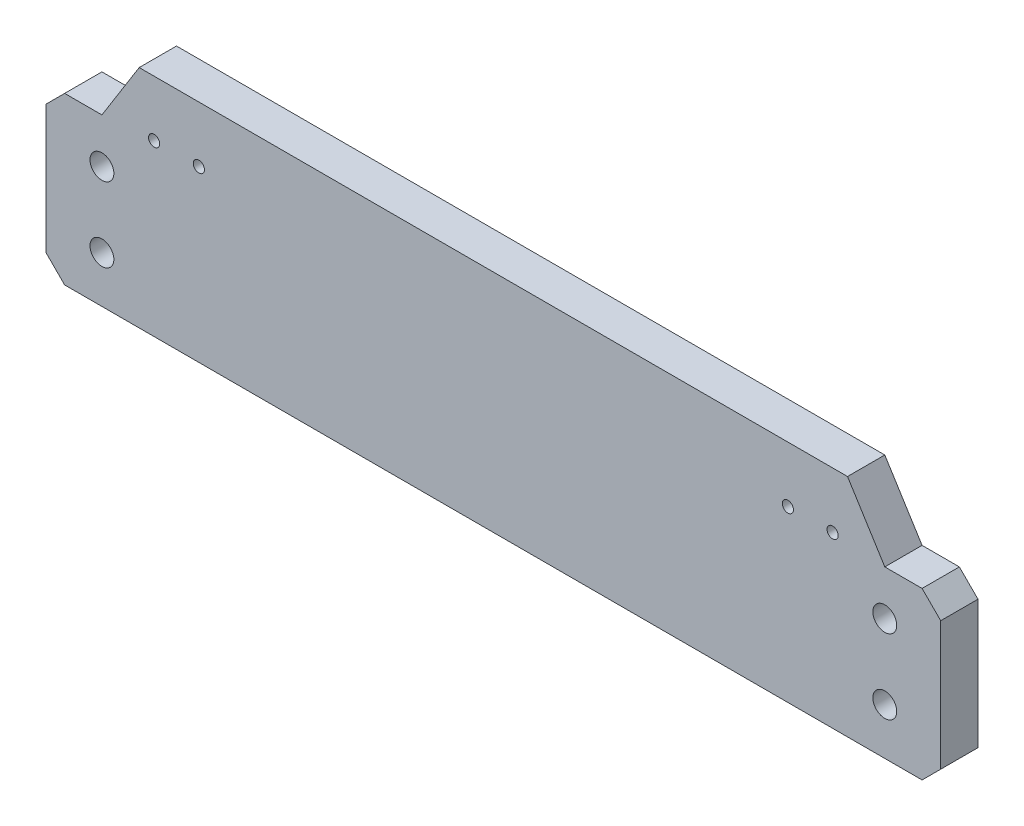
ISO-10303-21;
HEADER;
FILE_DESCRIPTION(('STEP AP214'),'2;1');
FILE_NAME('part.step','',(''),(''),'','','');
FILE_SCHEMA(('AUTOMOTIVE_DESIGN { 1 0 10303 214 1 1 1 1 }'));
ENDSEC;
DATA;
#1=APPLICATION_CONTEXT('core data for automotive mechanical design processes');
#2=APPLICATION_PROTOCOL_DEFINITION('international standard','automotive_design',2000,#1);
#3=PRODUCT_CONTEXT('',#1,'mechanical');
#4=PRODUCT('Part','Part','',(#3));
#5=PRODUCT_RELATED_PRODUCT_CATEGORY('part','',(#4));
#6=PRODUCT_DEFINITION_FORMATION('','',#4);
#7=PRODUCT_DEFINITION_CONTEXT('part definition',#1,'design');
#8=PRODUCT_DEFINITION('design','',#6,#7);
#9=PRODUCT_DEFINITION_SHAPE('','',#8);
#10=(LENGTH_UNIT() NAMED_UNIT(*) SI_UNIT(.MILLI.,.METRE.));
#11=(NAMED_UNIT(*) PLANE_ANGLE_UNIT() SI_UNIT($,.RADIAN.));
#12=(NAMED_UNIT(*) SI_UNIT($,.STERADIAN.) SOLID_ANGLE_UNIT());
#13=UNCERTAINTY_MEASURE_WITH_UNIT(LENGTH_MEASURE(1.E-05),#10,'distance_accuracy_value','');
#14=(GEOMETRIC_REPRESENTATION_CONTEXT(3) GLOBAL_UNCERTAINTY_ASSIGNED_CONTEXT((#13)) GLOBAL_UNIT_ASSIGNED_CONTEXT((#10,
#11,#12)) REPRESENTATION_CONTEXT('',''));
#15=CARTESIAN_POINT('',(0.,0.,0.));
#16=DIRECTION('',(0.,0.,1.));
#17=DIRECTION('',(1.,0.,0.));
#18=AXIS2_PLACEMENT_3D('',#15,#16,#17);
#19=CARTESIAN_POINT('',(0.,0.,10.));
#20=DIRECTION('',(0.,0.,-1.));
#21=DIRECTION('',(-1.,0.,0.));
#22=AXIS2_PLACEMENT_3D('',#19,#20,#21);
#23=PLANE('',#22);
#24=DIRECTION('',(1.,0.,0.));
#25=VECTOR('',#24,1.);
#26=CARTESIAN_POINT('',(-120.,-30.25,10.));
#27=LINE('',#26,#25);
#28=CARTESIAN_POINT('',(-115.,-30.25,10.));
#29=VERTEX_POINT('',#28);
#30=CARTESIAN_POINT('',(115.,-30.25,10.));
#31=VERTEX_POINT('',#30);
#32=EDGE_CURVE('E238',#29,#31,#27,.T.);
#33=ORIENTED_EDGE('',*,*,#32,.T.);
#34=DIRECTION('',(-0.707106781186549,-0.707106781186546,0.));
#35=VECTOR('',#34,1.);
#36=CARTESIAN_POINT('',(120.,-25.25,10.));
#37=LINE('',#36,#35);
#38=CARTESIAN_POINT('',(120.,-25.25,10.));
#39=VERTEX_POINT('',#38);
#40=EDGE_CURVE('E272',#31,#39,#37,.F.);
#41=ORIENTED_EDGE('',*,*,#40,.T.);
#42=DIRECTION('',(0.,1.,0.));
#43=VECTOR('',#42,1.);
#44=CARTESIAN_POINT('',(120.,-30.25,10.));
#45=LINE('',#44,#43);
#46=CARTESIAN_POINT('',(120.,9.24999999999996,10.));
#47=VERTEX_POINT('',#46);
#48=EDGE_CURVE('E230',#39,#47,#45,.T.);
#49=ORIENTED_EDGE('',*,*,#48,.T.);
#50=DIRECTION('',(0.70710678118655,-0.707106781186545,0.));
#51=VECTOR('',#50,1.);
#52=CARTESIAN_POINT('',(120.,9.24999999999996,10.));
#53=LINE('',#52,#51);
#54=CARTESIAN_POINT('',(115.,14.2499999999999,10.));
#55=VERTEX_POINT('',#54);
#56=EDGE_CURVE('E57',#47,#55,#53,.F.);
#57=ORIENTED_EDGE('',*,*,#56,.T.);
#58=DIRECTION('',(1.,0.,0.));
#59=VECTOR('',#58,1.);
#60=CARTESIAN_POINT('',(120.,14.2499999999999,10.));
#61=LINE('',#60,#59);
#62=CARTESIAN_POINT('',(105.,14.2499999999999,10.));
#63=VERTEX_POINT('',#62);
#64=EDGE_CURVE('E173',#63,#55,#61,.T.);
#65=ORIENTED_EDGE('',*,*,#64,.F.);
#66=DIRECTION('',(0.52999894000318,-0.847998304005088,0.));
#67=VECTOR('',#66,1.);
#68=CARTESIAN_POINT('',(105.,14.2499999999999,10.));
#69=LINE('',#68,#67);
#70=CARTESIAN_POINT('',(95.,30.2499999999999,10.));
#71=VERTEX_POINT('',#70);
#72=EDGE_CURVE('E164',#71,#63,#69,.T.);
#73=ORIENTED_EDGE('',*,*,#72,.F.);
#74=DIRECTION('',(-1.,0.,0.));
#75=VECTOR('',#74,1.);
#76=CARTESIAN_POINT('',(-120.,30.25,10.));
#77=LINE('',#76,#75);
#78=CARTESIAN_POINT('',(-95.,30.25,10.));
#79=VERTEX_POINT('',#78);
#80=EDGE_CURVE('E232',#71,#79,#77,.T.);
#81=ORIENTED_EDGE('',*,*,#80,.T.);
#82=DIRECTION('',(0.52999894000318,0.847998304005088,0.));
#83=VECTOR('',#82,1.);
#84=CARTESIAN_POINT('',(-105.,14.25,10.));
#85=LINE('',#84,#83);
#86=CARTESIAN_POINT('',(-105.,14.25,10.));
#87=VERTEX_POINT('',#86);
#88=EDGE_CURVE('E148',#87,#79,#85,.T.);
#89=ORIENTED_EDGE('',*,*,#88,.F.);
#90=DIRECTION('',(1.,0.,0.));
#91=VECTOR('',#90,1.);
#92=CARTESIAN_POINT('',(-120.,14.25,10.));
#93=LINE('',#92,#91);
#94=CARTESIAN_POINT('',(-115.,14.25,10.));
#95=VERTEX_POINT('',#94);
#96=EDGE_CURVE('E154',#95,#87,#93,.T.);
#97=ORIENTED_EDGE('',*,*,#96,.F.);
#98=DIRECTION('',(0.707106781186546,0.707106781186549,0.));
#99=VECTOR('',#98,1.);
#100=CARTESIAN_POINT('',(-115.,14.25,10.));
#101=LINE('',#100,#99);
#102=CARTESIAN_POINT('',(-120.,9.24999999999996,10.));
#103=VERTEX_POINT('',#102);
#104=EDGE_CURVE('E268',#95,#103,#101,.F.);
#105=ORIENTED_EDGE('',*,*,#104,.T.);
#106=DIRECTION('',(0.,-1.,0.));
#107=VECTOR('',#106,1.);
#108=CARTESIAN_POINT('',(-120.,-30.25,10.));
#109=LINE('',#108,#107);
#110=CARTESIAN_POINT('',(-120.,-25.25,10.));
#111=VERTEX_POINT('',#110);
#112=EDGE_CURVE('E236',#103,#111,#109,.T.);
#113=ORIENTED_EDGE('',*,*,#112,.T.);
#114=DIRECTION('',(-0.707106781186546,0.707106781186549,0.));
#115=VECTOR('',#114,1.);
#116=CARTESIAN_POINT('',(-115.,-30.25,10.));
#117=LINE('',#116,#115);
#118=EDGE_CURVE('E270',#111,#29,#117,.F.);
#119=ORIENTED_EDGE('',*,*,#118,.T.);
#120=EDGE_LOOP('',(#33,#41,#49,#57,#65,#73,#81,#89,#97,#105,#113,#119));
#121=FACE_BOUND('',#120,.T.);
#122=CARTESIAN_POINT('',(-105.,2.24999999999997,10.));
#123=DIRECTION('',(0.,0.,1.));
#124=DIRECTION('',(1.,0.,0.));
#125=AXIS2_PLACEMENT_3D('',#122,#123,#124);
#126=CIRCLE('',#125,3.2);
#127=CARTESIAN_POINT('',(-101.8,2.24999999999997,10.));
#128=VERTEX_POINT('',#127);
#129=EDGE_CURVE('E224',#128,#128,#126,.T.);
#130=ORIENTED_EDGE('',*,*,#129,.F.);
#131=EDGE_LOOP('',(#130));
#132=FACE_BOUND('',#131,.T.);
#133=CARTESIAN_POINT('',(-105.,-17.75,10.));
#134=DIRECTION('',(0.,0.,1.));
#135=DIRECTION('',(1.,0.,0.));
#136=AXIS2_PLACEMENT_3D('',#133,#134,#135);
#137=CIRCLE('',#136,3.2);
#138=CARTESIAN_POINT('',(-101.8,-17.75,10.));
#139=VERTEX_POINT('',#138);
#140=EDGE_CURVE('E218',#139,#139,#137,.T.);
#141=ORIENTED_EDGE('',*,*,#140,.F.);
#142=EDGE_LOOP('',(#141));
#143=FACE_BOUND('',#142,.T.);
#144=CARTESIAN_POINT('',(105.,-17.75,10.));
#145=DIRECTION('',(0.,0.,1.));
#146=DIRECTION('',(-1.,0.,0.));
#147=AXIS2_PLACEMENT_3D('',#144,#145,#146);
#148=CIRCLE('',#147,3.2);
#149=CARTESIAN_POINT('',(101.8,-17.75,10.));
#150=VERTEX_POINT('',#149);
#151=EDGE_CURVE('E212',#150,#150,#148,.T.);
#152=ORIENTED_EDGE('',*,*,#151,.F.);
#153=EDGE_LOOP('',(#152));
#154=FACE_BOUND('',#153,.T.);
#155=CARTESIAN_POINT('',(105.,2.25,10.));
#156=DIRECTION('',(0.,0.,1.));
#157=DIRECTION('',(-1.,0.,0.));
#158=AXIS2_PLACEMENT_3D('',#155,#156,#157);
#159=CIRCLE('',#158,3.2);
#160=CARTESIAN_POINT('',(101.8,2.25,10.));
#161=VERTEX_POINT('',#160);
#162=EDGE_CURVE('E206',#161,#161,#159,.T.);
#163=ORIENTED_EDGE('',*,*,#162,.F.);
#164=EDGE_LOOP('',(#163));
#165=FACE_BOUND('',#164,.T.);
#166=CARTESIAN_POINT('',(-91.,15.25,10.));
#167=DIRECTION('',(0.,0.,1.));
#168=DIRECTION('',(1.,0.,0.));
#169=AXIS2_PLACEMENT_3D('',#166,#167,#168);
#170=CIRCLE('',#169,1.5);
#171=CARTESIAN_POINT('',(-89.5,15.25,10.));
#172=VERTEX_POINT('',#171);
#173=EDGE_CURVE('E200',#172,#172,#170,.T.);
#174=ORIENTED_EDGE('',*,*,#173,.F.);
#175=EDGE_LOOP('',(#174));
#176=FACE_BOUND('',#175,.T.);
#177=CARTESIAN_POINT('',(-79.,15.25,10.));
#178=DIRECTION('',(0.,0.,1.));
#179=DIRECTION('',(1.,0.,0.));
#180=AXIS2_PLACEMENT_3D('',#177,#178,#179);
#181=CIRCLE('',#180,1.5);
#182=CARTESIAN_POINT('',(-77.5,15.25,10.));
#183=VERTEX_POINT('',#182);
#184=EDGE_CURVE('E194',#183,#183,#181,.T.);
#185=ORIENTED_EDGE('',*,*,#184,.F.);
#186=EDGE_LOOP('',(#185));
#187=FACE_BOUND('',#186,.T.);
#188=CARTESIAN_POINT('',(79.,15.25,10.));
#189=DIRECTION('',(0.,0.,1.));
#190=DIRECTION('',(-1.,0.,0.));
#191=AXIS2_PLACEMENT_3D('',#188,#189,#190);
#192=CIRCLE('',#191,1.5);
#193=CARTESIAN_POINT('',(77.5,15.25,10.));
#194=VERTEX_POINT('',#193);
#195=EDGE_CURVE('E188',#194,#194,#192,.T.);
#196=ORIENTED_EDGE('',*,*,#195,.F.);
#197=EDGE_LOOP('',(#196));
#198=FACE_BOUND('',#197,.T.);
#199=CARTESIAN_POINT('',(91.,15.25,10.));
#200=DIRECTION('',(0.,0.,1.));
#201=DIRECTION('',(-1.,0.,0.));
#202=AXIS2_PLACEMENT_3D('',#199,#200,#201);
#203=CIRCLE('',#202,1.5);
#204=CARTESIAN_POINT('',(89.5,15.25,10.));
#205=VERTEX_POINT('',#204);
#206=EDGE_CURVE('E182',#205,#205,#203,.T.);
#207=ORIENTED_EDGE('',*,*,#206,.F.);
#208=EDGE_LOOP('',(#207));
#209=FACE_BOUND('',#208,.T.);
#210=ADVANCED_FACE('F41',(#121,#132,#143,#154,#165,#176,#187,#198,#209),#23,.F.);
#211=CARTESIAN_POINT('',(0.,0.,0.));
#212=DIRECTION('',(0.,0.,-1.));
#213=DIRECTION('',(-1.,0.,0.));
#214=AXIS2_PLACEMENT_3D('',#211,#212,#213);
#215=PLANE('',#214);
#216=DIRECTION('',(0.,1.,0.));
#217=VECTOR('',#216,1.);
#218=CARTESIAN_POINT('',(120.,-30.25,0.));
#219=LINE('',#218,#217);
#220=CARTESIAN_POINT('',(120.,-25.25,0.));
#221=VERTEX_POINT('',#220);
#222=CARTESIAN_POINT('',(120.,9.24999999999996,0.));
#223=VERTEX_POINT('',#222);
#224=EDGE_CURVE('E227',#221,#223,#219,.T.);
#225=ORIENTED_EDGE('',*,*,#224,.F.);
#226=DIRECTION('',(0.707106781186549,0.707106781186546,0.));
#227=VECTOR('',#226,1.);
#228=CARTESIAN_POINT('',(72.6249999999997,-72.6250000000001,0.));
#229=LINE('',#228,#227);
#230=CARTESIAN_POINT('',(115.,-30.25,0.));
#231=VERTEX_POINT('',#230);
#232=EDGE_CURVE('E260',#221,#231,#229,.F.);
#233=ORIENTED_EDGE('',*,*,#232,.T.);
#234=DIRECTION('',(1.,0.,0.));
#235=VECTOR('',#234,1.);
#236=CARTESIAN_POINT('',(-120.,-30.25,0.));
#237=LINE('',#236,#235);
#238=CARTESIAN_POINT('',(-115.,-30.25,0.));
#239=VERTEX_POINT('',#238);
#240=EDGE_CURVE('E233',#239,#231,#237,.T.);
#241=ORIENTED_EDGE('',*,*,#240,.F.);
#242=DIRECTION('',(0.707106781186546,-0.707106781186549,0.));
#243=VECTOR('',#242,1.);
#244=CARTESIAN_POINT('',(-72.6250000000003,-72.6249999999999,0.));
#245=LINE('',#244,#243);
#246=CARTESIAN_POINT('',(-120.,-25.25,0.));
#247=VERTEX_POINT('',#246);
#248=EDGE_CURVE('E258',#239,#247,#245,.F.);
#249=ORIENTED_EDGE('',*,*,#248,.T.);
#250=DIRECTION('',(0.,-1.,0.));
#251=VECTOR('',#250,1.);
#252=CARTESIAN_POINT('',(-120.,-30.25,0.));
#253=LINE('',#252,#251);
#254=CARTESIAN_POINT('',(-120.,9.24999999999996,0.));
#255=VERTEX_POINT('',#254);
#256=EDGE_CURVE('E246',#255,#247,#253,.T.);
#257=ORIENTED_EDGE('',*,*,#256,.F.);
#258=DIRECTION('',(-0.707106781186546,-0.707106781186549,0.));
#259=VECTOR('',#258,1.);
#260=CARTESIAN_POINT('',(-64.6250000000003,64.6249999999999,0.));
#261=LINE('',#260,#259);
#262=CARTESIAN_POINT('',(-115.,14.25,0.));
#263=VERTEX_POINT('',#262);
#264=EDGE_CURVE('E144',#255,#263,#261,.F.);
#265=ORIENTED_EDGE('',*,*,#264,.T.);
#266=DIRECTION('',(1.,0.,0.));
#267=VECTOR('',#266,1.);
#268=CARTESIAN_POINT('',(-120.,14.25,0.));
#269=LINE('',#268,#267);
#270=CARTESIAN_POINT('',(-105.,14.25,0.));
#271=VERTEX_POINT('',#270);
#272=EDGE_CURVE('E133',#263,#271,#269,.T.);
#273=ORIENTED_EDGE('',*,*,#272,.T.);
#274=DIRECTION('',(0.52999894000318,0.847998304005088,0.));
#275=VECTOR('',#274,1.);
#276=CARTESIAN_POINT('',(-105.,14.25,0.));
#277=LINE('',#276,#275);
#278=CARTESIAN_POINT('',(-95.,30.25,0.));
#279=VERTEX_POINT('',#278);
#280=EDGE_CURVE('E140',#271,#279,#277,.T.);
#281=ORIENTED_EDGE('',*,*,#280,.T.);
#282=DIRECTION('',(-1.,0.,0.));
#283=VECTOR('',#282,1.);
#284=CARTESIAN_POINT('',(-120.,30.25,0.));
#285=LINE('',#284,#283);
#286=CARTESIAN_POINT('',(95.,30.25,0.));
#287=VERTEX_POINT('',#286);
#288=EDGE_CURVE('E244',#287,#279,#285,.T.);
#289=ORIENTED_EDGE('',*,*,#288,.F.);
#290=DIRECTION('',(0.52999894000318,-0.847998304005088,0.));
#291=VECTOR('',#290,1.);
#292=CARTESIAN_POINT('',(105.,14.2499999999999,0.));
#293=LINE('',#292,#291);
#294=CARTESIAN_POINT('',(105.,14.2499999999999,0.));
#295=VERTEX_POINT('',#294);
#296=EDGE_CURVE('E175',#287,#295,#293,.T.);
#297=ORIENTED_EDGE('',*,*,#296,.T.);
#298=DIRECTION('',(1.,0.,0.));
#299=VECTOR('',#298,1.);
#300=CARTESIAN_POINT('',(120.,14.2499999999999,0.));
#301=LINE('',#300,#299);
#302=CARTESIAN_POINT('',(115.,14.2499999999999,0.));
#303=VERTEX_POINT('',#302);
#304=EDGE_CURVE('E170',#295,#303,#301,.T.);
#305=ORIENTED_EDGE('',*,*,#304,.T.);
#306=DIRECTION('',(-0.70710678118655,0.707106781186545,0.));
#307=VECTOR('',#306,1.);
#308=CARTESIAN_POINT('',(64.6249999999995,64.625,0.));
#309=LINE('',#308,#307);
#310=EDGE_CURVE('E255',#303,#223,#309,.F.);
#311=ORIENTED_EDGE('',*,*,#310,.T.);
#312=EDGE_LOOP('',(#225,#233,#241,#249,#257,#265,#273,#281,#289,#297,#305,#311));
#313=FACE_BOUND('',#312,.T.);
#314=CARTESIAN_POINT('',(79.,15.25,0.));
#315=DIRECTION('',(0.,0.,1.));
#316=DIRECTION('',(-1.,0.,0.));
#317=AXIS2_PLACEMENT_3D('',#314,#315,#316);
#318=CIRCLE('',#317,1.5);
#319=CARTESIAN_POINT('',(77.5,15.25,0.));
#320=VERTEX_POINT('',#319);
#321=EDGE_CURVE('E185',#320,#320,#318,.T.);
#322=ORIENTED_EDGE('',*,*,#321,.T.);
#323=EDGE_LOOP('',(#322));
#324=FACE_BOUND('',#323,.T.);
#325=CARTESIAN_POINT('',(-91.,15.25,0.));
#326=DIRECTION('',(0.,0.,1.));
#327=DIRECTION('',(1.,0.,0.));
#328=AXIS2_PLACEMENT_3D('',#325,#326,#327);
#329=CIRCLE('',#328,1.5);
#330=CARTESIAN_POINT('',(-89.5,15.25,0.));
#331=VERTEX_POINT('',#330);
#332=EDGE_CURVE('E197',#331,#331,#329,.T.);
#333=ORIENTED_EDGE('',*,*,#332,.T.);
#334=EDGE_LOOP('',(#333));
#335=FACE_BOUND('',#334,.T.);
#336=CARTESIAN_POINT('',(105.,-17.75,0.));
#337=DIRECTION('',(0.,0.,1.));
#338=DIRECTION('',(-1.,0.,0.));
#339=AXIS2_PLACEMENT_3D('',#336,#337,#338);
#340=CIRCLE('',#339,3.2);
#341=CARTESIAN_POINT('',(101.8,-17.75,0.));
#342=VERTEX_POINT('',#341);
#343=EDGE_CURVE('E209',#342,#342,#340,.T.);
#344=ORIENTED_EDGE('',*,*,#343,.T.);
#345=EDGE_LOOP('',(#344));
#346=FACE_BOUND('',#345,.T.);
#347=CARTESIAN_POINT('',(-105.,2.24999999999997,0.));
#348=DIRECTION('',(0.,0.,1.));
#349=DIRECTION('',(1.,0.,0.));
#350=AXIS2_PLACEMENT_3D('',#347,#348,#349);
#351=CIRCLE('',#350,3.2);
#352=CARTESIAN_POINT('',(-101.8,2.24999999999997,0.));
#353=VERTEX_POINT('',#352);
#354=EDGE_CURVE('E221',#353,#353,#351,.T.);
#355=ORIENTED_EDGE('',*,*,#354,.T.);
#356=EDGE_LOOP('',(#355));
#357=FACE_BOUND('',#356,.T.);
#358=CARTESIAN_POINT('',(-105.,-17.75,0.));
#359=DIRECTION('',(0.,0.,1.));
#360=DIRECTION('',(1.,0.,0.));
#361=AXIS2_PLACEMENT_3D('',#358,#359,#360);
#362=CIRCLE('',#361,3.2);
#363=CARTESIAN_POINT('',(-101.8,-17.75,0.));
#364=VERTEX_POINT('',#363);
#365=EDGE_CURVE('E215',#364,#364,#362,.T.);
#366=ORIENTED_EDGE('',*,*,#365,.T.);
#367=EDGE_LOOP('',(#366));
#368=FACE_BOUND('',#367,.T.);
#369=CARTESIAN_POINT('',(105.,2.25,0.));
#370=DIRECTION('',(0.,0.,1.));
#371=DIRECTION('',(-1.,0.,0.));
#372=AXIS2_PLACEMENT_3D('',#369,#370,#371);
#373=CIRCLE('',#372,3.2);
#374=CARTESIAN_POINT('',(101.8,2.25,0.));
#375=VERTEX_POINT('',#374);
#376=EDGE_CURVE('E203',#375,#375,#373,.T.);
#377=ORIENTED_EDGE('',*,*,#376,.T.);
#378=EDGE_LOOP('',(#377));
#379=FACE_BOUND('',#378,.T.);
#380=CARTESIAN_POINT('',(-79.,15.25,0.));
#381=DIRECTION('',(0.,0.,1.));
#382=DIRECTION('',(1.,0.,0.));
#383=AXIS2_PLACEMENT_3D('',#380,#381,#382);
#384=CIRCLE('',#383,1.5);
#385=CARTESIAN_POINT('',(-77.5,15.25,0.));
#386=VERTEX_POINT('',#385);
#387=EDGE_CURVE('E191',#386,#386,#384,.T.);
#388=ORIENTED_EDGE('',*,*,#387,.T.);
#389=EDGE_LOOP('',(#388));
#390=FACE_BOUND('',#389,.T.);
#391=CARTESIAN_POINT('',(91.,15.25,0.));
#392=DIRECTION('',(0.,0.,1.));
#393=DIRECTION('',(-1.,0.,0.));
#394=AXIS2_PLACEMENT_3D('',#391,#392,#393);
#395=CIRCLE('',#394,1.5);
#396=CARTESIAN_POINT('',(89.5,15.25,0.));
#397=VERTEX_POINT('',#396);
#398=EDGE_CURVE('E166',#397,#397,#395,.T.);
#399=ORIENTED_EDGE('',*,*,#398,.T.);
#400=EDGE_LOOP('',(#399));
#401=FACE_BOUND('',#400,.T.);
#402=ADVANCED_FACE('F136',(#313,#324,#335,#346,#357,#368,#379,#390,#401),#215,.T.);
#403=CARTESIAN_POINT('',(120.,-30.25,10.));
#404=DIRECTION('',(-1.,0.,0.));
#405=DIRECTION('',(0.,-1.,0.));
#406=AXIS2_PLACEMENT_3D('',#403,#404,#405);
#407=PLANE('',#406);
#408=ORIENTED_EDGE('',*,*,#48,.F.);
#409=DIRECTION('',(0.,0.,-1.));
#410=VECTOR('',#409,1.);
#411=CARTESIAN_POINT('',(120.,-25.25,10.));
#412=LINE('',#411,#410);
#413=EDGE_CURVE('E252',#39,#221,#412,.T.);
#414=ORIENTED_EDGE('',*,*,#413,.T.);
#415=ORIENTED_EDGE('',*,*,#224,.T.);
#416=DIRECTION('',(0.,0.,1.));
#417=VECTOR('',#416,1.);
#418=CARTESIAN_POINT('',(120.,9.24999999999996,10.));
#419=LINE('',#418,#417);
#420=EDGE_CURVE('E241',#223,#47,#419,.T.);
#421=ORIENTED_EDGE('',*,*,#420,.T.);
#422=EDGE_LOOP('',(#408,#414,#415,#421));
#423=FACE_BOUND('',#422,.T.);
#424=ADVANCED_FACE('F294',(#423),#407,.F.);
#425=CARTESIAN_POINT('',(-120.,30.25,10.));
#426=DIRECTION('',(0.,-1.,0.));
#427=DIRECTION('',(1.,0.,0.));
#428=AXIS2_PLACEMENT_3D('',#425,#426,#427);
#429=PLANE('',#428);
#430=ORIENTED_EDGE('',*,*,#288,.T.);
#431=DIRECTION('',(0.,0.,1.));
#432=VECTOR('',#431,1.);
#433=CARTESIAN_POINT('',(-95.,30.25,0.));
#434=LINE('',#433,#432);
#435=EDGE_CURVE('E157',#279,#79,#434,.T.);
#436=ORIENTED_EDGE('',*,*,#435,.T.);
#437=ORIENTED_EDGE('',*,*,#80,.F.);
#438=DIRECTION('',(0.,0.,1.));
#439=VECTOR('',#438,1.);
#440=CARTESIAN_POINT('',(95.,30.2499999999999,0.));
#441=LINE('',#440,#439);
#442=EDGE_CURVE('E168',#287,#71,#441,.T.);
#443=ORIENTED_EDGE('',*,*,#442,.F.);
#444=EDGE_LOOP('',(#430,#436,#437,#443));
#445=FACE_BOUND('',#444,.T.);
#446=ADVANCED_FACE('F281',(#445),#429,.F.);
#447=CARTESIAN_POINT('',(-120.,-30.25,10.));
#448=DIRECTION('',(1.,0.,0.));
#449=DIRECTION('',(0.,0.,-1.));
#450=AXIS2_PLACEMENT_3D('',#447,#448,#449);
#451=PLANE('',#450);
#452=ORIENTED_EDGE('',*,*,#256,.T.);
#453=DIRECTION('',(0.,0.,1.));
#454=VECTOR('',#453,1.);
#455=CARTESIAN_POINT('',(-120.,-25.25,10.));
#456=LINE('',#455,#454);
#457=EDGE_CURVE('E65',#247,#111,#456,.T.);
#458=ORIENTED_EDGE('',*,*,#457,.T.);
#459=ORIENTED_EDGE('',*,*,#112,.F.);
#460=DIRECTION('',(0.,0.,-1.));
#461=VECTOR('',#460,1.);
#462=CARTESIAN_POINT('',(-120.,9.24999999999996,10.));
#463=LINE('',#462,#461);
#464=EDGE_CURVE('E274',#103,#255,#463,.T.);
#465=ORIENTED_EDGE('',*,*,#464,.T.);
#466=EDGE_LOOP('',(#452,#458,#459,#465));
#467=FACE_BOUND('',#466,.T.);
#468=ADVANCED_FACE('F308',(#467),#451,.F.);
#469=CARTESIAN_POINT('',(-120.,-30.25,10.));
#470=DIRECTION('',(0.,1.,0.));
#471=DIRECTION('',(-1.,0.,0.));
#472=AXIS2_PLACEMENT_3D('',#469,#470,#471);
#473=PLANE('',#472);
#474=ORIENTED_EDGE('',*,*,#240,.T.);
#475=DIRECTION('',(0.,0.,1.));
#476=VECTOR('',#475,1.);
#477=CARTESIAN_POINT('',(115.,-30.25,10.));
#478=LINE('',#477,#476);
#479=EDGE_CURVE('E265',#231,#31,#478,.T.);
#480=ORIENTED_EDGE('',*,*,#479,.T.);
#481=ORIENTED_EDGE('',*,*,#32,.F.);
#482=DIRECTION('',(0.,0.,-1.));
#483=VECTOR('',#482,1.);
#484=CARTESIAN_POINT('',(-115.,-30.25,10.));
#485=LINE('',#484,#483);
#486=EDGE_CURVE('E262',#29,#239,#485,.T.);
#487=ORIENTED_EDGE('',*,*,#486,.T.);
#488=EDGE_LOOP('',(#474,#480,#481,#487));
#489=FACE_BOUND('',#488,.T.);
#490=ADVANCED_FACE('F302',(#489),#473,.F.);
#491=CARTESIAN_POINT('',(-105.,2.24999999999997,10.));
#492=DIRECTION('',(0.,0.,-1.));
#493=DIRECTION('',(-1.,0.,0.));
#494=AXIS2_PLACEMENT_3D('',#491,#492,#493);
#495=CYLINDRICAL_SURFACE('',#494,3.2);
#496=ORIENTED_EDGE('',*,*,#129,.T.);
#497=EDGE_LOOP('',(#496));
#498=FACE_BOUND('',#497,.T.);
#499=ORIENTED_EDGE('',*,*,#354,.F.);
#500=EDGE_LOOP('',(#499));
#501=FACE_BOUND('',#500,.T.);
#502=ADVANCED_FACE('F326',(#498,#501),#495,.F.);
#503=CARTESIAN_POINT('',(-105.,-17.75,10.));
#504=DIRECTION('',(0.,0.,-1.));
#505=DIRECTION('',(-1.,0.,0.));
#506=AXIS2_PLACEMENT_3D('',#503,#504,#505);
#507=CYLINDRICAL_SURFACE('',#506,3.2);
#508=ORIENTED_EDGE('',*,*,#140,.T.);
#509=EDGE_LOOP('',(#508));
#510=FACE_BOUND('',#509,.T.);
#511=ORIENTED_EDGE('',*,*,#365,.F.);
#512=EDGE_LOOP('',(#511));
#513=FACE_BOUND('',#512,.T.);
#514=ADVANCED_FACE('F381',(#510,#513),#507,.F.);
#515=CARTESIAN_POINT('',(105.,-17.75,10.));
#516=DIRECTION('',(0.,0.,-1.));
#517=DIRECTION('',(-1.,0.,0.));
#518=AXIS2_PLACEMENT_3D('',#515,#516,#517);
#519=CYLINDRICAL_SURFACE('',#518,3.2);
#520=ORIENTED_EDGE('',*,*,#151,.T.);
#521=EDGE_LOOP('',(#520));
#522=FACE_BOUND('',#521,.T.);
#523=ORIENTED_EDGE('',*,*,#343,.F.);
#524=EDGE_LOOP('',(#523));
#525=FACE_BOUND('',#524,.T.);
#526=ADVANCED_FACE('F378',(#522,#525),#519,.F.);
#527=CARTESIAN_POINT('',(105.,2.25,10.));
#528=DIRECTION('',(0.,0.,-1.));
#529=DIRECTION('',(-1.,0.,0.));
#530=AXIS2_PLACEMENT_3D('',#527,#528,#529);
#531=CYLINDRICAL_SURFACE('',#530,3.2);
#532=ORIENTED_EDGE('',*,*,#162,.T.);
#533=EDGE_LOOP('',(#532));
#534=FACE_BOUND('',#533,.T.);
#535=ORIENTED_EDGE('',*,*,#376,.F.);
#536=EDGE_LOOP('',(#535));
#537=FACE_BOUND('',#536,.T.);
#538=ADVANCED_FACE('F374',(#534,#537),#531,.F.);
#539=CARTESIAN_POINT('',(-91.,15.25,10.));
#540=DIRECTION('',(0.,0.,-1.));
#541=DIRECTION('',(-1.,0.,0.));
#542=AXIS2_PLACEMENT_3D('',#539,#540,#541);
#543=CYLINDRICAL_SURFACE('',#542,1.5);
#544=ORIENTED_EDGE('',*,*,#173,.T.);
#545=EDGE_LOOP('',(#544));
#546=FACE_BOUND('',#545,.T.);
#547=ORIENTED_EDGE('',*,*,#332,.F.);
#548=EDGE_LOOP('',(#547));
#549=FACE_BOUND('',#548,.T.);
#550=ADVANCED_FACE('F370',(#546,#549),#543,.F.);
#551=CARTESIAN_POINT('',(-79.,15.25,10.));
#552=DIRECTION('',(0.,0.,-1.));
#553=DIRECTION('',(-1.,0.,0.));
#554=AXIS2_PLACEMENT_3D('',#551,#552,#553);
#555=CYLINDRICAL_SURFACE('',#554,1.5);
#556=ORIENTED_EDGE('',*,*,#184,.T.);
#557=EDGE_LOOP('',(#556));
#558=FACE_BOUND('',#557,.T.);
#559=ORIENTED_EDGE('',*,*,#387,.F.);
#560=EDGE_LOOP('',(#559));
#561=FACE_BOUND('',#560,.T.);
#562=ADVANCED_FACE('F366',(#558,#561),#555,.F.);
#563=CARTESIAN_POINT('',(79.,15.25,10.));
#564=DIRECTION('',(0.,0.,-1.));
#565=DIRECTION('',(-1.,0.,0.));
#566=AXIS2_PLACEMENT_3D('',#563,#564,#565);
#567=CYLINDRICAL_SURFACE('',#566,1.5);
#568=ORIENTED_EDGE('',*,*,#195,.T.);
#569=EDGE_LOOP('',(#568));
#570=FACE_BOUND('',#569,.T.);
#571=ORIENTED_EDGE('',*,*,#321,.F.);
#572=EDGE_LOOP('',(#571));
#573=FACE_BOUND('',#572,.T.);
#574=ADVANCED_FACE('F362',(#570,#573),#567,.F.);
#575=CARTESIAN_POINT('',(91.,15.25,10.));
#576=DIRECTION('',(0.,0.,-1.));
#577=DIRECTION('',(-1.,0.,0.));
#578=AXIS2_PLACEMENT_3D('',#575,#576,#577);
#579=CYLINDRICAL_SURFACE('',#578,1.5);
#580=ORIENTED_EDGE('',*,*,#206,.T.);
#581=EDGE_LOOP('',(#580));
#582=FACE_BOUND('',#581,.T.);
#583=ORIENTED_EDGE('',*,*,#398,.F.);
#584=EDGE_LOOP('',(#583));
#585=FACE_BOUND('',#584,.T.);
#586=ADVANCED_FACE('F359',(#582,#585),#579,.F.);
#587=CARTESIAN_POINT('',(-105.,14.25,0.));
#588=DIRECTION('',(0.847998304005088,-0.52999894000318,0.));
#589=DIRECTION('',(0.52999894000318,0.847998304005088,0.));
#590=AXIS2_PLACEMENT_3D('',#587,#588,#589);
#591=PLANE('',#590);
#592=ORIENTED_EDGE('',*,*,#88,.T.);
#593=ORIENTED_EDGE('',*,*,#435,.F.);
#594=ORIENTED_EDGE('',*,*,#280,.F.);
#595=DIRECTION('',(0.,0.,1.));
#596=VECTOR('',#595,1.);
#597=CARTESIAN_POINT('',(-105.,14.25,0.));
#598=LINE('',#597,#596);
#599=EDGE_CURVE('E151',#271,#87,#598,.T.);
#600=ORIENTED_EDGE('',*,*,#599,.T.);
#601=EDGE_LOOP('',(#592,#593,#594,#600));
#602=FACE_BOUND('',#601,.T.);
#603=ADVANCED_FACE('F159',(#602),#591,.F.);
#604=CARTESIAN_POINT('',(-120.,14.25,0.));
#605=DIRECTION('',(0.,-1.,0.));
#606=DIRECTION('',(0.,0.,-1.));
#607=AXIS2_PLACEMENT_3D('',#604,#605,#606);
#608=PLANE('',#607);
#609=ORIENTED_EDGE('',*,*,#272,.F.);
#610=DIRECTION('',(0.,0.,1.));
#611=VECTOR('',#610,1.);
#612=CARTESIAN_POINT('',(-115.,14.25,0.));
#613=LINE('',#612,#611);
#614=EDGE_CURVE('E50',#263,#95,#613,.T.);
#615=ORIENTED_EDGE('',*,*,#614,.T.);
#616=ORIENTED_EDGE('',*,*,#96,.T.);
#617=ORIENTED_EDGE('',*,*,#599,.F.);
#618=EDGE_LOOP('',(#609,#615,#616,#617));
#619=FACE_BOUND('',#618,.T.);
#620=ADVANCED_FACE('F152',(#619),#608,.F.);
#621=CARTESIAN_POINT('',(120.,14.2499999999999,0.));
#622=DIRECTION('',(0.,-1.,0.));
#623=DIRECTION('',(1.,0.,0.));
#624=AXIS2_PLACEMENT_3D('',#621,#622,#623);
#625=PLANE('',#624);
#626=ORIENTED_EDGE('',*,*,#64,.T.);
#627=DIRECTION('',(0.,0.,-1.));
#628=VECTOR('',#627,1.);
#629=CARTESIAN_POINT('',(115.,14.2499999999999,0.));
#630=LINE('',#629,#628);
#631=EDGE_CURVE('E11',#55,#303,#630,.T.);
#632=ORIENTED_EDGE('',*,*,#631,.T.);
#633=ORIENTED_EDGE('',*,*,#304,.F.);
#634=DIRECTION('',(0.,0.,1.));
#635=VECTOR('',#634,1.);
#636=CARTESIAN_POINT('',(105.,14.2499999999999,0.));
#637=LINE('',#636,#635);
#638=EDGE_CURVE('E171',#295,#63,#637,.T.);
#639=ORIENTED_EDGE('',*,*,#638,.T.);
#640=EDGE_LOOP('',(#626,#632,#633,#639));
#641=FACE_BOUND('',#640,.T.);
#642=ADVANCED_FACE('F288',(#641),#625,.F.);
#643=CARTESIAN_POINT('',(105.,14.2499999999999,0.));
#644=DIRECTION('',(-0.847998304005088,-0.52999894000318,0.));
#645=DIRECTION('',(0.52999894000318,-0.847998304005088,0.));
#646=AXIS2_PLACEMENT_3D('',#643,#644,#645);
#647=PLANE('',#646);
#648=ORIENTED_EDGE('',*,*,#72,.T.);
#649=ORIENTED_EDGE('',*,*,#638,.F.);
#650=ORIENTED_EDGE('',*,*,#296,.F.);
#651=ORIENTED_EDGE('',*,*,#442,.T.);
#652=EDGE_LOOP('',(#648,#649,#650,#651));
#653=FACE_BOUND('',#652,.T.);
#654=ADVANCED_FACE('F286',(#653),#647,.F.);
#655=CARTESIAN_POINT('',(120.,-25.25,10.));
#656=DIRECTION('',(-0.707106781186545,0.707106781186549,0.));
#657=DIRECTION('',(0.,0.,-1.));
#658=AXIS2_PLACEMENT_3D('',#655,#656,#657);
#659=PLANE('',#658);
#660=ORIENTED_EDGE('',*,*,#40,.F.);
#661=ORIENTED_EDGE('',*,*,#479,.F.);
#662=ORIENTED_EDGE('',*,*,#232,.F.);
#663=ORIENTED_EDGE('',*,*,#413,.F.);
#664=EDGE_LOOP('',(#660,#661,#662,#663));
#665=FACE_BOUND('',#664,.T.);
#666=ADVANCED_FACE('F298',(#665),#659,.F.);
#667=CARTESIAN_POINT('',(-115.,-30.25,10.));
#668=DIRECTION('',(0.707106781186549,0.707106781186545,0.));
#669=DIRECTION('',(0.,0.,-1.));
#670=AXIS2_PLACEMENT_3D('',#667,#668,#669);
#671=PLANE('',#670);
#672=ORIENTED_EDGE('',*,*,#118,.F.);
#673=ORIENTED_EDGE('',*,*,#457,.F.);
#674=ORIENTED_EDGE('',*,*,#248,.F.);
#675=ORIENTED_EDGE('',*,*,#486,.F.);
#676=EDGE_LOOP('',(#672,#673,#674,#675));
#677=FACE_BOUND('',#676,.T.);
#678=ADVANCED_FACE('F307',(#677),#671,.F.);
#679=CARTESIAN_POINT('',(-115.,14.25,0.));
#680=DIRECTION('',(0.707106781186549,-0.707106781186545,0.));
#681=DIRECTION('',(0.,0.,1.));
#682=AXIS2_PLACEMENT_3D('',#679,#680,#681);
#683=PLANE('',#682);
#684=ORIENTED_EDGE('',*,*,#264,.F.);
#685=ORIENTED_EDGE('',*,*,#464,.F.);
#686=ORIENTED_EDGE('',*,*,#104,.F.);
#687=ORIENTED_EDGE('',*,*,#614,.F.);
#688=EDGE_LOOP('',(#684,#685,#686,#687));
#689=FACE_BOUND('',#688,.T.);
#690=ADVANCED_FACE('F310',(#689),#683,.F.);
#691=CARTESIAN_POINT('',(120.,9.24999999999996,10.));
#692=DIRECTION('',(-0.707106781186545,-0.70710678118655,0.));
#693=DIRECTION('',(0.,0.,1.));
#694=AXIS2_PLACEMENT_3D('',#691,#692,#693);
#695=PLANE('',#694);
#696=ORIENTED_EDGE('',*,*,#310,.F.);
#697=ORIENTED_EDGE('',*,*,#631,.F.);
#698=ORIENTED_EDGE('',*,*,#56,.F.);
#699=ORIENTED_EDGE('',*,*,#420,.F.);
#700=EDGE_LOOP('',(#696,#697,#698,#699));
#701=FACE_BOUND('',#700,.T.);
#702=ADVANCED_FACE('F44',(#701),#695,.F.);
#703=CLOSED_SHELL('',(#210,#402,#424,#446,#468,#490,#502,#514,#526,#538,#550,#562,#574,#586,
#603,#620,#642,#654,#666,#678,#690,#702));
#704=MANIFOLD_SOLID_BREP('B2',#703);
#705=ADVANCED_BREP_SHAPE_REPRESENTATION('',(#18,#704),#14);
#706=SHAPE_DEFINITION_REPRESENTATION(#9,#705);
ENDSEC;
END-ISO-10303-21;
